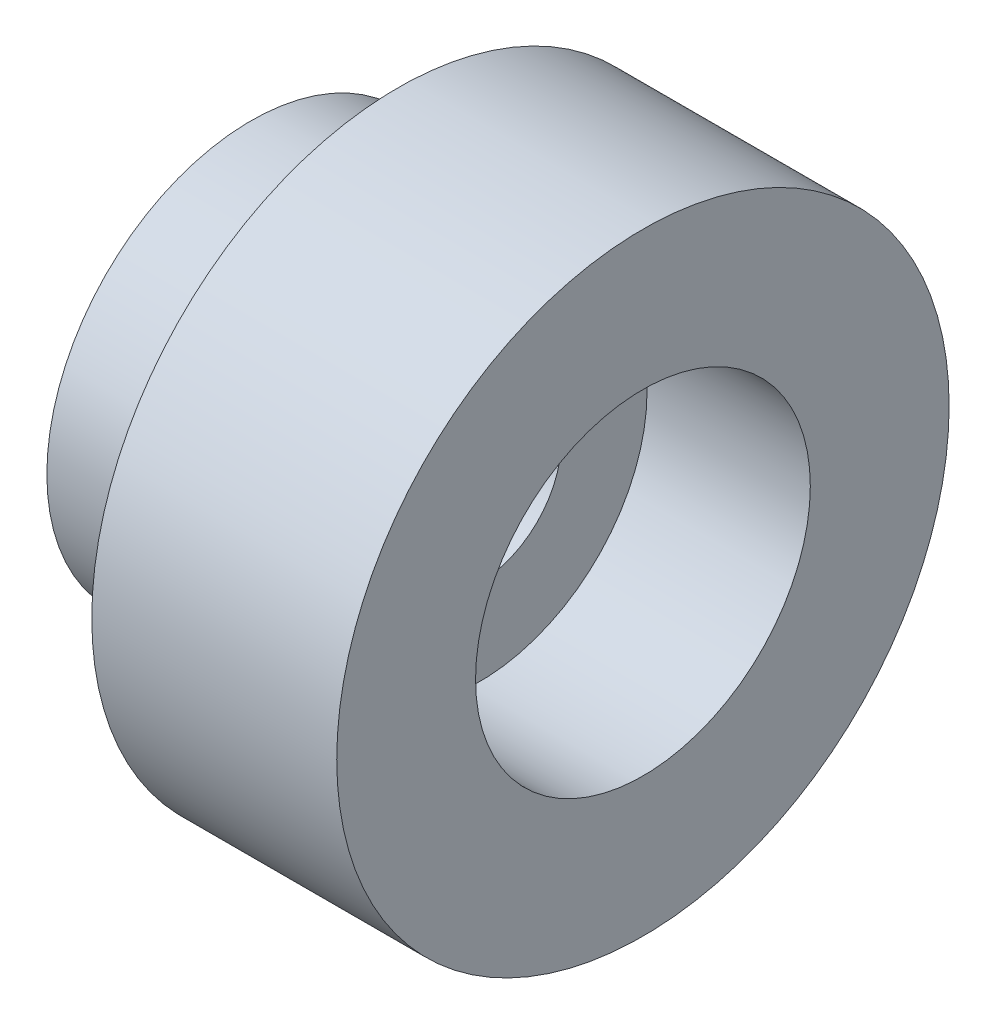
ISO-10303-21;
HEADER;
FILE_DESCRIPTION(('STEP AP214'),'2;1');
FILE_NAME('part.step','',(''),(''),'','','');
FILE_SCHEMA(('AUTOMOTIVE_DESIGN { 1 0 10303 214 1 1 1 1 }'));
ENDSEC;
DATA;
#1=APPLICATION_CONTEXT('core data for automotive mechanical design processes');
#2=APPLICATION_PROTOCOL_DEFINITION('international standard','automotive_design',2000,#1);
#3=PRODUCT_CONTEXT('',#1,'mechanical');
#4=PRODUCT('Part','Part','',(#3));
#5=PRODUCT_RELATED_PRODUCT_CATEGORY('part','',(#4));
#6=PRODUCT_DEFINITION_FORMATION('','',#4);
#7=PRODUCT_DEFINITION_CONTEXT('part definition',#1,'design');
#8=PRODUCT_DEFINITION('design','',#6,#7);
#9=PRODUCT_DEFINITION_SHAPE('','',#8);
#10=(LENGTH_UNIT() NAMED_UNIT(*) SI_UNIT(.MILLI.,.METRE.));
#11=(NAMED_UNIT(*) PLANE_ANGLE_UNIT() SI_UNIT($,.RADIAN.));
#12=(NAMED_UNIT(*) SI_UNIT($,.STERADIAN.) SOLID_ANGLE_UNIT());
#13=UNCERTAINTY_MEASURE_WITH_UNIT(LENGTH_MEASURE(1.E-05),#10,'distance_accuracy_value','');
#14=(GEOMETRIC_REPRESENTATION_CONTEXT(3) GLOBAL_UNCERTAINTY_ASSIGNED_CONTEXT((#13)) GLOBAL_UNIT_ASSIGNED_CONTEXT((#10,
#11,#12)) REPRESENTATION_CONTEXT('',''));
#15=CARTESIAN_POINT('',(0.,0.,0.));
#16=DIRECTION('',(0.,0.,1.));
#17=DIRECTION('',(1.,0.,0.));
#18=AXIS2_PLACEMENT_3D('',#15,#16,#17);
#19=CARTESIAN_POINT('',(0.,2.5,0.));
#20=DIRECTION('',(1.,0.,0.));
#21=DIRECTION('',(0.,0.,-1.));
#22=AXIS2_PLACEMENT_3D('',#19,#20,#21);
#23=PLANE('',#22);
#24=CARTESIAN_POINT('',(0.,0.,0.));
#25=DIRECTION('',(-1.,0.,0.));
#26=DIRECTION('',(0.,0.,1.));
#27=AXIS2_PLACEMENT_3D('',#24,#25,#26);
#28=CIRCLE('',#27,1.);
#29=CARTESIAN_POINT('',(0.,0.,1.));
#30=VERTEX_POINT('',#29);
#31=EDGE_CURVE('E10',#30,#30,#28,.T.);
#32=ORIENTED_EDGE('',*,*,#31,.F.);
#33=EDGE_LOOP('',(#32));
#34=FACE_BOUND('',#33,.T.);
#35=CARTESIAN_POINT('',(0.,0.,0.));
#36=DIRECTION('',(-1.,0.,0.));
#37=DIRECTION('',(0.,0.,1.));
#38=AXIS2_PLACEMENT_3D('',#35,#36,#37);
#39=CIRCLE('',#38,2.5);
#40=CARTESIAN_POINT('',(0.,0.,2.5));
#41=VERTEX_POINT('',#40);
#42=EDGE_CURVE('E72',#41,#41,#39,.T.);
#43=ORIENTED_EDGE('',*,*,#42,.T.);
#44=EDGE_LOOP('',(#43));
#45=FACE_BOUND('',#44,.T.);
#46=ADVANCED_FACE('F37',(#34,#45),#23,.F.);
#47=CARTESIAN_POINT('',(0.,0.,0.));
#48=DIRECTION('',(-1.,0.,0.));
#49=DIRECTION('',(0.,0.,1.));
#50=AXIS2_PLACEMENT_3D('',#47,#48,#49);
#51=CYLINDRICAL_SURFACE('',#50,1.);
#52=CARTESIAN_POINT('',(2.8,0.,0.));
#53=DIRECTION('',(-1.,0.,0.));
#54=DIRECTION('',(0.,0.,1.));
#55=AXIS2_PLACEMENT_3D('',#52,#53,#54);
#56=CIRCLE('',#55,1.);
#57=CARTESIAN_POINT('',(2.8,0.,1.));
#58=VERTEX_POINT('',#57);
#59=EDGE_CURVE('E44',#58,#58,#56,.T.);
#60=ORIENTED_EDGE('',*,*,#59,.F.);
#61=EDGE_LOOP('',(#60));
#62=FACE_BOUND('',#61,.T.);
#63=ORIENTED_EDGE('',*,*,#31,.T.);
#64=EDGE_LOOP('',(#63));
#65=FACE_BOUND('',#64,.T.);
#66=ADVANCED_FACE('F110',(#62,#65),#51,.F.);
#67=CARTESIAN_POINT('',(2.8,1.,0.));
#68=DIRECTION('',(-1.,0.,0.));
#69=DIRECTION('',(0.,0.,1.));
#70=AXIS2_PLACEMENT_3D('',#67,#68,#69);
#71=PLANE('',#70);
#72=CARTESIAN_POINT('',(2.8,0.,0.));
#73=DIRECTION('',(-1.,0.,0.));
#74=DIRECTION('',(0.,0.,1.));
#75=AXIS2_PLACEMENT_3D('',#72,#73,#74);
#76=CIRCLE('',#75,2.05);
#77=CARTESIAN_POINT('',(2.8,0.,2.05));
#78=VERTEX_POINT('',#77);
#79=EDGE_CURVE('E49',#78,#78,#76,.T.);
#80=ORIENTED_EDGE('',*,*,#79,.F.);
#81=EDGE_LOOP('',(#80));
#82=FACE_BOUND('',#81,.T.);
#83=ORIENTED_EDGE('',*,*,#59,.T.);
#84=EDGE_LOOP('',(#83));
#85=FACE_BOUND('',#84,.T.);
#86=ADVANCED_FACE('F105',(#82,#85),#71,.F.);
#87=CARTESIAN_POINT('',(0.,0.,0.));
#88=DIRECTION('',(-1.,0.,0.));
#89=DIRECTION('',(0.,0.,1.));
#90=AXIS2_PLACEMENT_3D('',#87,#88,#89);
#91=CYLINDRICAL_SURFACE('',#90,2.05);
#92=CARTESIAN_POINT('',(4.8,0.,0.));
#93=DIRECTION('',(-1.,0.,0.));
#94=DIRECTION('',(0.,0.,1.));
#95=AXIS2_PLACEMENT_3D('',#92,#93,#94);
#96=CIRCLE('',#95,2.05);
#97=CARTESIAN_POINT('',(4.8,0.,2.05));
#98=VERTEX_POINT('',#97);
#99=EDGE_CURVE('E54',#98,#98,#96,.T.);
#100=ORIENTED_EDGE('',*,*,#99,.F.);
#101=EDGE_LOOP('',(#100));
#102=FACE_BOUND('',#101,.T.);
#103=ORIENTED_EDGE('',*,*,#79,.T.);
#104=EDGE_LOOP('',(#103));
#105=FACE_BOUND('',#104,.T.);
#106=ADVANCED_FACE('F99',(#102,#105),#91,.F.);
#107=CARTESIAN_POINT('',(4.8,2.05,0.));
#108=DIRECTION('',(-1.,0.,0.));
#109=DIRECTION('',(0.,0.,1.));
#110=AXIS2_PLACEMENT_3D('',#107,#108,#109);
#111=PLANE('',#110);
#112=CARTESIAN_POINT('',(4.8,0.,0.));
#113=DIRECTION('',(-1.,0.,0.));
#114=DIRECTION('',(0.,0.,1.));
#115=AXIS2_PLACEMENT_3D('',#112,#113,#114);
#116=CIRCLE('',#115,3.75);
#117=CARTESIAN_POINT('',(4.8,0.,3.75));
#118=VERTEX_POINT('',#117);
#119=EDGE_CURVE('E60',#118,#118,#116,.T.);
#120=ORIENTED_EDGE('',*,*,#119,.F.);
#121=EDGE_LOOP('',(#120));
#122=FACE_BOUND('',#121,.T.);
#123=ORIENTED_EDGE('',*,*,#99,.T.);
#124=EDGE_LOOP('',(#123));
#125=FACE_BOUND('',#124,.T.);
#126=ADVANCED_FACE('F93',(#122,#125),#111,.F.);
#127=CARTESIAN_POINT('',(0.,0.,0.));
#128=DIRECTION('',(-1.,0.,0.));
#129=DIRECTION('',(0.,0.,1.));
#130=AXIS2_PLACEMENT_3D('',#127,#128,#129);
#131=CYLINDRICAL_SURFACE('',#130,3.75);
#132=CARTESIAN_POINT('',(1.8,0.,0.));
#133=DIRECTION('',(-1.,0.,0.));
#134=DIRECTION('',(0.,0.,1.));
#135=AXIS2_PLACEMENT_3D('',#132,#133,#134);
#136=CIRCLE('',#135,3.75);
#137=CARTESIAN_POINT('',(1.8,0.,3.75));
#138=VERTEX_POINT('',#137);
#139=EDGE_CURVE('E64',#138,#138,#136,.T.);
#140=ORIENTED_EDGE('',*,*,#139,.F.);
#141=EDGE_LOOP('',(#140));
#142=FACE_BOUND('',#141,.T.);
#143=ORIENTED_EDGE('',*,*,#119,.T.);
#144=EDGE_LOOP('',(#143));
#145=FACE_BOUND('',#144,.T.);
#146=ADVANCED_FACE('F87',(#142,#145),#131,.T.);
#147=CARTESIAN_POINT('',(1.8,3.75,0.));
#148=DIRECTION('',(1.,0.,0.));
#149=DIRECTION('',(0.,0.,-1.));
#150=AXIS2_PLACEMENT_3D('',#147,#148,#149);
#151=PLANE('',#150);
#152=CARTESIAN_POINT('',(1.8,0.,0.));
#153=DIRECTION('',(-1.,0.,0.));
#154=DIRECTION('',(0.,0.,1.));
#155=AXIS2_PLACEMENT_3D('',#152,#153,#154);
#156=CIRCLE('',#155,2.5);
#157=CARTESIAN_POINT('',(1.8,0.,2.5));
#158=VERTEX_POINT('',#157);
#159=EDGE_CURVE('E68',#158,#158,#156,.T.);
#160=ORIENTED_EDGE('',*,*,#159,.F.);
#161=EDGE_LOOP('',(#160));
#162=FACE_BOUND('',#161,.T.);
#163=ORIENTED_EDGE('',*,*,#139,.T.);
#164=EDGE_LOOP('',(#163));
#165=FACE_BOUND('',#164,.T.);
#166=ADVANCED_FACE('F81',(#162,#165),#151,.F.);
#167=CARTESIAN_POINT('',(0.,0.,0.));
#168=DIRECTION('',(-1.,0.,0.));
#169=DIRECTION('',(0.,0.,1.));
#170=AXIS2_PLACEMENT_3D('',#167,#168,#169);
#171=CYLINDRICAL_SURFACE('',#170,2.5);
#172=ORIENTED_EDGE('',*,*,#42,.F.);
#173=EDGE_LOOP('',(#172));
#174=FACE_BOUND('',#173,.T.);
#175=ORIENTED_EDGE('',*,*,#159,.T.);
#176=EDGE_LOOP('',(#175));
#177=FACE_BOUND('',#176,.T.);
#178=ADVANCED_FACE('F78',(#174,#177),#171,.T.);
#179=CLOSED_SHELL('',(#46,#66,#86,#106,#126,#146,#166,#178));
#180=MANIFOLD_SOLID_BREP('B2',#179);
#181=ADVANCED_BREP_SHAPE_REPRESENTATION('',(#18,#180),#14);
#182=SHAPE_DEFINITION_REPRESENTATION(#9,#181);
ENDSEC;
END-ISO-10303-21;
